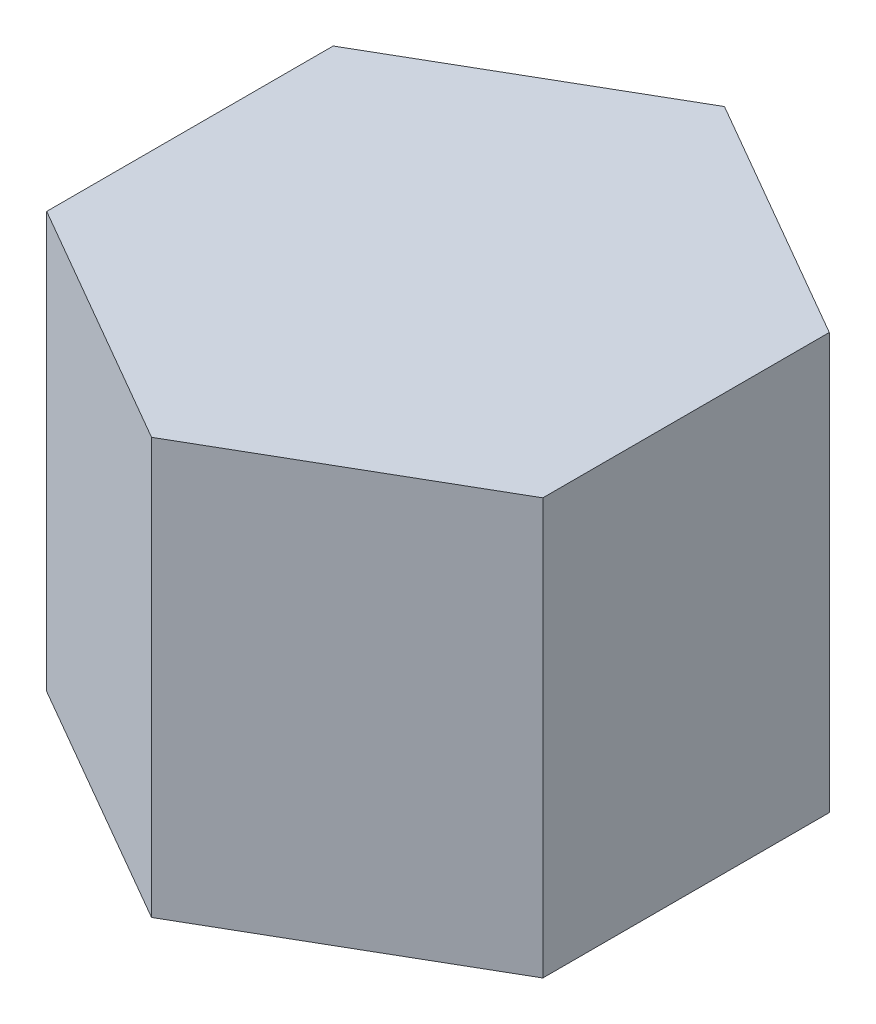
ISO-10303-21;
HEADER;
FILE_DESCRIPTION(('STEP AP214'),'2;1');
FILE_NAME('part.step','',(''),(''),'','','');
FILE_SCHEMA(('AUTOMOTIVE_DESIGN { 1 0 10303 214 1 1 1 1 }'));
ENDSEC;
DATA;
#1=APPLICATION_CONTEXT('core data for automotive mechanical design processes');
#2=APPLICATION_PROTOCOL_DEFINITION('international standard','automotive_design',2000,#1);
#3=PRODUCT_CONTEXT('',#1,'mechanical');
#4=PRODUCT('Part','Part','',(#3));
#5=PRODUCT_RELATED_PRODUCT_CATEGORY('part','',(#4));
#6=PRODUCT_DEFINITION_FORMATION('','',#4);
#7=PRODUCT_DEFINITION_CONTEXT('part definition',#1,'design');
#8=PRODUCT_DEFINITION('design','',#6,#7);
#9=PRODUCT_DEFINITION_SHAPE('','',#8);
#10=(LENGTH_UNIT() NAMED_UNIT(*) SI_UNIT(.MILLI.,.METRE.));
#11=(NAMED_UNIT(*) PLANE_ANGLE_UNIT() SI_UNIT($,.RADIAN.));
#12=(NAMED_UNIT(*) SI_UNIT($,.STERADIAN.) SOLID_ANGLE_UNIT());
#13=UNCERTAINTY_MEASURE_WITH_UNIT(LENGTH_MEASURE(1.E-05),#10,'distance_accuracy_value','');
#14=(GEOMETRIC_REPRESENTATION_CONTEXT(3) GLOBAL_UNCERTAINTY_ASSIGNED_CONTEXT((#13)) GLOBAL_UNIT_ASSIGNED_CONTEXT((#10,
#11,#12)) REPRESENTATION_CONTEXT('',''));
#15=CARTESIAN_POINT('',(0.,0.,0.));
#16=DIRECTION('',(0.,0.,1.));
#17=DIRECTION('',(1.,0.,0.));
#18=AXIS2_PLACEMENT_3D('',#15,#16,#17);
#19=CARTESIAN_POINT('',(203.642660308706,-148.537700895744,293.239022028063));
#20=DIRECTION('',(-0.499999999999909,0.,-0.866025403784491));
#21=DIRECTION('',(-0.866025403784491,0.,0.499999999999909));
#22=AXIS2_PLACEMENT_3D('',#19,#20,#21);
#23=PLANE('',#22);
#24=CARTESIAN_POINT('',(203.339551417382,-149.045793579175,293.414022028063));
#25=DIRECTION('',(0.866025403784491,0.,-0.499999999999909));
#26=VECTOR('',#25,1.);
#27=LINE('',#24,#26);
#28=CARTESIAN_POINT('',(203.339551417382,-149.045793579175,293.414022028063));
#29=VERTEX_POINT('',#28);
#30=CARTESIAN_POINT('',(203.642660308706,-149.045793579175,293.239022028063));
#31=VERTEX_POINT('',#30);
#32=EDGE_CURVE('E170',#29,#31,#27,.T.);
#33=ORIENTED_EDGE('',*,*,#32,.T.);
#34=CARTESIAN_POINT('',(203.642660308706,-148.537700895744,293.239022028063));
#35=DIRECTION('',(0.,-1.,0.));
#36=VECTOR('',#35,1.);
#37=LINE('',#34,#36);
#38=CARTESIAN_POINT('',(203.642660308706,-148.537700895744,293.239022028063));
#39=VERTEX_POINT('',#38);
#40=EDGE_CURVE('E35',#39,#31,#37,.T.);
#41=ORIENTED_EDGE('',*,*,#40,.F.);
#42=CARTESIAN_POINT('',(203.339551417382,-148.537700895744,293.414022028063));
#43=DIRECTION('',(0.866025403784491,0.,-0.499999999999909));
#44=VECTOR('',#43,1.);
#45=LINE('',#42,#44);
#46=CARTESIAN_POINT('',(203.339551417382,-148.537700895744,293.414022028063));
#47=VERTEX_POINT('',#46);
#48=EDGE_CURVE('E159',#47,#39,#45,.T.);
#49=ORIENTED_EDGE('',*,*,#48,.F.);
#50=CARTESIAN_POINT('',(203.339551417382,-148.537700895744,293.414022028063));
#51=DIRECTION('',(0.,-1.,0.));
#52=VECTOR('',#51,1.);
#53=LINE('',#50,#52);
#54=EDGE_CURVE('E10',#47,#29,#53,.T.);
#55=ORIENTED_EDGE('',*,*,#54,.T.);
#56=EDGE_LOOP('',(#33,#41,#49,#55));
#57=FACE_BOUND('',#56,.T.);
#58=ADVANCED_FACE('F16',(#57),#23,.F.);
#59=CARTESIAN_POINT('',(203.339551417382,-148.537700895744,293.414022028063));
#60=DIRECTION('',(0.499999999999978,0.,-0.866025403784452));
#61=DIRECTION('',(-0.866025403784452,0.,-0.499999999999978));
#62=AXIS2_PLACEMENT_3D('',#59,#60,#61);
#63=PLANE('',#62);
#64=CARTESIAN_POINT('',(203.036442526057,-149.045793579175,293.239022028063));
#65=DIRECTION('',(0.866025403784452,0.,0.499999999999978));
#66=VECTOR('',#65,1.);
#67=LINE('',#64,#66);
#68=CARTESIAN_POINT('',(203.036442526057,-149.045793579175,293.239022028063));
#69=VERTEX_POINT('',#68);
#70=EDGE_CURVE('E167',#69,#29,#67,.T.);
#71=ORIENTED_EDGE('',*,*,#70,.T.);
#72=ORIENTED_EDGE('',*,*,#54,.F.);
#73=CARTESIAN_POINT('',(203.036442526057,-148.537700895744,293.239022028063));
#74=DIRECTION('',(0.866025403784452,0.,0.499999999999978));
#75=VECTOR('',#74,1.);
#76=LINE('',#73,#75);
#77=CARTESIAN_POINT('',(203.036442526057,-148.537700895744,293.239022028063));
#78=VERTEX_POINT('',#77);
#79=EDGE_CURVE('E156',#78,#47,#76,.T.);
#80=ORIENTED_EDGE('',*,*,#79,.F.);
#81=CARTESIAN_POINT('',(203.036442526057,-148.537700895744,293.239022028063));
#82=DIRECTION('',(0.,-1.,0.));
#83=VECTOR('',#82,1.);
#84=LINE('',#81,#83);
#85=EDGE_CURVE('E27',#78,#69,#84,.T.);
#86=ORIENTED_EDGE('',*,*,#85,.T.);
#87=EDGE_LOOP('',(#71,#72,#80,#86));
#88=FACE_BOUND('',#87,.T.);
#89=ADVANCED_FACE('F189',(#88),#63,.F.);
#90=CARTESIAN_POINT('',(203.036442526057,-148.537700895744,290.831971220494));
#91=DIRECTION('',(1.,0.,0.));
#92=DIRECTION('',(0.,1.,0.));
#93=AXIS2_PLACEMENT_3D('',#90,#91,#92);
#94=PLANE('',#93);
#95=CARTESIAN_POINT('',(203.036442526057,-149.045793579175,292.889022028063));
#96=DIRECTION('',(0.,0.,1.));
#97=VECTOR('',#96,1.);
#98=LINE('',#95,#97);
#99=CARTESIAN_POINT('',(203.036442526057,-149.045793579175,292.889022028063));
#100=VERTEX_POINT('',#99);
#101=EDGE_CURVE('E163',#100,#69,#98,.T.);
#102=ORIENTED_EDGE('',*,*,#101,.T.);
#103=ORIENTED_EDGE('',*,*,#85,.F.);
#104=CARTESIAN_POINT('',(203.036442526057,-148.537700895744,292.889022028063));
#105=DIRECTION('',(0.,0.,1.));
#106=VECTOR('',#105,1.);
#107=LINE('',#104,#106);
#108=CARTESIAN_POINT('',(203.036442526057,-148.537700895744,292.889022028063));
#109=VERTEX_POINT('',#108);
#110=EDGE_CURVE('E106',#109,#78,#107,.T.);
#111=ORIENTED_EDGE('',*,*,#110,.F.);
#112=CARTESIAN_POINT('',(203.036442526057,-148.537700895744,292.889022028063));
#113=DIRECTION('',(0.,-1.,0.));
#114=VECTOR('',#113,1.);
#115=LINE('',#112,#114);
#116=EDGE_CURVE('E94',#109,#100,#115,.T.);
#117=ORIENTED_EDGE('',*,*,#116,.T.);
#118=EDGE_LOOP('',(#102,#103,#111,#117));
#119=FACE_BOUND('',#118,.T.);
#120=ADVANCED_FACE('F198',(#119),#94,.F.);
#121=CARTESIAN_POINT('',(203.036442526057,-148.537700895744,292.889022028063));
#122=DIRECTION('',(0.499999999999943,0.,0.866025403784472));
#123=DIRECTION('',(0.866025403784472,0.,-0.499999999999943));
#124=AXIS2_PLACEMENT_3D('',#121,#122,#123);
#125=PLANE('',#124);
#126=CARTESIAN_POINT('',(203.339551417382,-149.045793579175,292.714022028063));
#127=DIRECTION('',(-0.866025403784471,0.,0.499999999999943));
#128=VECTOR('',#127,1.);
#129=LINE('',#126,#128);
#130=CARTESIAN_POINT('',(203.339551417382,-149.045793579175,292.714022028063));
#131=VERTEX_POINT('',#130);
#132=EDGE_CURVE('E162',#131,#100,#129,.T.);
#133=ORIENTED_EDGE('',*,*,#132,.T.);
#134=ORIENTED_EDGE('',*,*,#116,.F.);
#135=CARTESIAN_POINT('',(203.339551417382,-148.537700895744,292.714022028063));
#136=DIRECTION('',(-0.866025403784471,0.,0.499999999999943));
#137=VECTOR('',#136,1.);
#138=LINE('',#135,#137);
#139=CARTESIAN_POINT('',(203.339551417382,-148.537700895744,292.714022028063));
#140=VERTEX_POINT('',#139);
#141=EDGE_CURVE('E98',#140,#109,#138,.T.);
#142=ORIENTED_EDGE('',*,*,#141,.F.);
#143=CARTESIAN_POINT('',(203.339551417382,-148.537700895744,292.714022028063));
#144=DIRECTION('',(0.,-1.,0.));
#145=VECTOR('',#144,1.);
#146=LINE('',#143,#145);
#147=EDGE_CURVE('E79',#140,#131,#146,.T.);
#148=ORIENTED_EDGE('',*,*,#147,.T.);
#149=EDGE_LOOP('',(#133,#134,#142,#148));
#150=FACE_BOUND('',#149,.T.);
#151=ADVANCED_FACE('F100',(#150),#125,.F.);
#152=CARTESIAN_POINT('',(203.339551417381,-148.537700895744,292.714022028063));
#153=DIRECTION('',(-0.500000000000028,0.,0.866025403784423));
#154=DIRECTION('',(0.866025403784423,0.,0.500000000000028));
#155=AXIS2_PLACEMENT_3D('',#152,#153,#154);
#156=PLANE('',#155);
#157=CARTESIAN_POINT('',(203.642660308706,-149.045793579175,292.889022028063));
#158=DIRECTION('',(-0.866025403784422,0.,-0.500000000000028));
#159=VECTOR('',#158,1.);
#160=LINE('',#157,#159);
#161=CARTESIAN_POINT('',(203.642660308706,-149.045793579175,292.889022028063));
#162=VERTEX_POINT('',#161);
#163=EDGE_CURVE('E88',#162,#131,#160,.T.);
#164=ORIENTED_EDGE('',*,*,#163,.T.);
#165=ORIENTED_EDGE('',*,*,#147,.F.);
#166=CARTESIAN_POINT('',(203.642660308706,-148.537700895744,292.889022028063));
#167=DIRECTION('',(-0.866025403784422,0.,-0.500000000000028));
#168=VECTOR('',#167,1.);
#169=LINE('',#166,#168);
#170=CARTESIAN_POINT('',(203.642660308706,-148.537700895744,292.889022028063));
#171=VERTEX_POINT('',#170);
#172=EDGE_CURVE('E84',#171,#140,#169,.T.);
#173=ORIENTED_EDGE('',*,*,#172,.F.);
#174=CARTESIAN_POINT('',(203.642660308706,-148.537700895744,292.889022028063));
#175=DIRECTION('',(0.,-1.,0.));
#176=VECTOR('',#175,1.);
#177=LINE('',#174,#176);
#178=EDGE_CURVE('E58',#171,#162,#177,.T.);
#179=ORIENTED_EDGE('',*,*,#178,.T.);
#180=EDGE_LOOP('',(#164,#165,#173,#179));
#181=FACE_BOUND('',#180,.T.);
#182=ADVANCED_FACE('F82',(#181),#156,.F.);
#183=CARTESIAN_POINT('',(203.642660308706,-148.537700895744,290.831971220494));
#184=DIRECTION('',(-1.,0.,0.));
#185=DIRECTION('',(0.,-1.,0.));
#186=AXIS2_PLACEMENT_3D('',#183,#184,#185);
#187=PLANE('',#186);
#188=CARTESIAN_POINT('',(203.642660308706,-149.045793579175,293.239022028063));
#189=DIRECTION('',(0.,0.,-1.));
#190=VECTOR('',#189,1.);
#191=LINE('',#188,#190);
#192=EDGE_CURVE('E160',#31,#162,#191,.T.);
#193=ORIENTED_EDGE('',*,*,#192,.T.);
#194=ORIENTED_EDGE('',*,*,#178,.F.);
#195=CARTESIAN_POINT('',(203.642660308706,-148.537700895744,293.239022028063));
#196=DIRECTION('',(0.,0.,-1.));
#197=VECTOR('',#196,1.);
#198=LINE('',#195,#197);
#199=EDGE_CURVE('E112',#39,#171,#198,.T.);
#200=ORIENTED_EDGE('',*,*,#199,.F.);
#201=ORIENTED_EDGE('',*,*,#40,.T.);
#202=EDGE_LOOP('',(#193,#194,#200,#201));
#203=FACE_BOUND('',#202,.T.);
#204=ADVANCED_FACE('F131',(#203),#187,.F.);
#205=CARTESIAN_POINT('',(206.339551417382,-148.537700895744,290.831971220494));
#206=DIRECTION('',(0.,-1.,0.));
#207=DIRECTION('',(1.,0.,0.));
#208=AXIS2_PLACEMENT_3D('',#205,#206,#207);
#209=PLANE('',#208);
#210=ORIENTED_EDGE('',*,*,#48,.T.);
#211=ORIENTED_EDGE('',*,*,#199,.T.);
#212=ORIENTED_EDGE('',*,*,#172,.T.);
#213=ORIENTED_EDGE('',*,*,#141,.T.);
#214=ORIENTED_EDGE('',*,*,#110,.T.);
#215=ORIENTED_EDGE('',*,*,#79,.T.);
#216=EDGE_LOOP('',(#210,#211,#212,#213,#214,#215));
#217=FACE_BOUND('',#216,.T.);
#218=ADVANCED_FACE('F111',(#217),#209,.F.);
#219=CARTESIAN_POINT('',(206.339551417382,-149.045793579175,290.831971220494));
#220=DIRECTION('',(0.,-1.,0.));
#221=DIRECTION('',(1.,0.,0.));
#222=AXIS2_PLACEMENT_3D('',#219,#220,#221);
#223=PLANE('',#222);
#224=ORIENTED_EDGE('',*,*,#32,.F.);
#225=ORIENTED_EDGE('',*,*,#70,.F.);
#226=ORIENTED_EDGE('',*,*,#101,.F.);
#227=ORIENTED_EDGE('',*,*,#132,.F.);
#228=ORIENTED_EDGE('',*,*,#163,.F.);
#229=ORIENTED_EDGE('',*,*,#192,.F.);
#230=EDGE_LOOP('',(#224,#225,#226,#227,#228,#229));
#231=FACE_BOUND('',#230,.T.);
#232=ADVANCED_FACE('F130',(#231),#223,.T.);
#233=CLOSED_SHELL('',(#58,#89,#120,#151,#182,#204,#218,#232));
#234=MANIFOLD_SOLID_BREP('B1',#233);
#235=ADVANCED_BREP_SHAPE_REPRESENTATION('',(#18,#234),#14);
#236=SHAPE_DEFINITION_REPRESENTATION(#9,#235);
ENDSEC;
END-ISO-10303-21;
